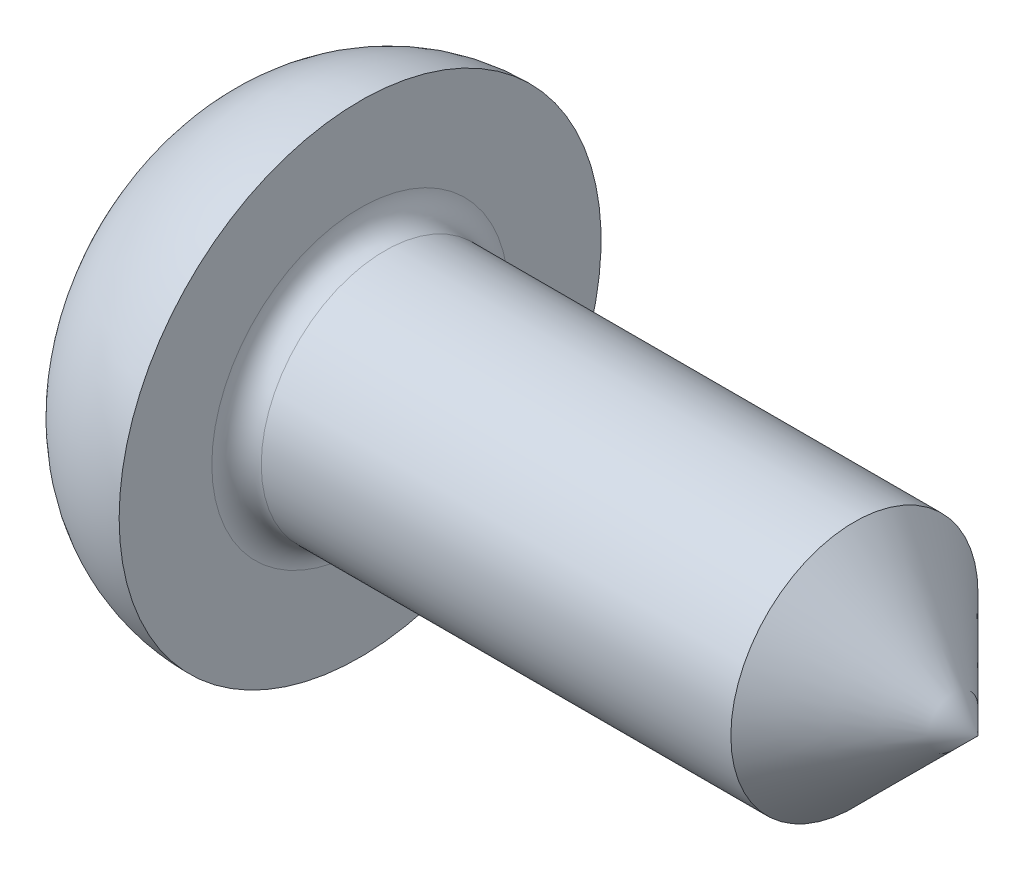
ISO-10303-21;
HEADER;
FILE_DESCRIPTION(('STEP AP214'),'2;1');
FILE_NAME('part.step','',(''),(''),'','','');
FILE_SCHEMA(('AUTOMOTIVE_DESIGN { 1 0 10303 214 1 1 1 1 }'));
ENDSEC;
DATA;
#1=APPLICATION_CONTEXT('core data for automotive mechanical design processes');
#2=APPLICATION_PROTOCOL_DEFINITION('international standard','automotive_design',2000,#1);
#3=PRODUCT_CONTEXT('',#1,'mechanical');
#4=PRODUCT('Part','Part','',(#3));
#5=PRODUCT_RELATED_PRODUCT_CATEGORY('part','',(#4));
#6=PRODUCT_DEFINITION_FORMATION('','',#4);
#7=PRODUCT_DEFINITION_CONTEXT('part definition',#1,'design');
#8=PRODUCT_DEFINITION('design','',#6,#7);
#9=PRODUCT_DEFINITION_SHAPE('','',#8);
#10=(LENGTH_UNIT() NAMED_UNIT(*) SI_UNIT(.MILLI.,.METRE.));
#11=(NAMED_UNIT(*) PLANE_ANGLE_UNIT() SI_UNIT($,.RADIAN.));
#12=(NAMED_UNIT(*) SI_UNIT($,.STERADIAN.) SOLID_ANGLE_UNIT());
#13=UNCERTAINTY_MEASURE_WITH_UNIT(LENGTH_MEASURE(1.E-05),#10,'distance_accuracy_value','');
#14=(GEOMETRIC_REPRESENTATION_CONTEXT(3) GLOBAL_UNCERTAINTY_ASSIGNED_CONTEXT((#13)) GLOBAL_UNIT_ASSIGNED_CONTEXT((#10,
#11,#12)) REPRESENTATION_CONTEXT('',''));
#15=CARTESIAN_POINT('',(0.,0.,0.));
#16=DIRECTION('',(0.,0.,1.));
#17=DIRECTION('',(1.,0.,0.));
#18=AXIS2_PLACEMENT_3D('',#15,#16,#17);
#19=CARTESIAN_POINT('',(-13.6292682926829,0.,0.));
#20=DIRECTION('',(-1.,0.,0.));
#21=DIRECTION('',(0.,0.,1.));
#22=AXIS2_PLACEMENT_3D('',#19,#20,#21);
#23=CYLINDRICAL_SURFACE('',#22,1.);
#24=CARTESIAN_POINT('',(1.8,0.,0.));
#25=DIRECTION('',(-1.,0.,0.));
#26=DIRECTION('',(0.,0.,1.));
#27=AXIS2_PLACEMENT_3D('',#24,#25,#26);
#28=CIRCLE('',#27,1.);
#29=CARTESIAN_POINT('',(1.8,0.,1.));
#30=VERTEX_POINT('',#29);
#31=EDGE_CURVE('E219',#30,#30,#28,.F.);
#32=ORIENTED_EDGE('',*,*,#31,.T.);
#33=EDGE_LOOP('',(#32));
#34=FACE_BOUND('',#33,.T.);
#35=CARTESIAN_POINT('',(5.6,0.,0.));
#36=DIRECTION('',(-1.,0.,0.));
#37=DIRECTION('',(0.,0.,1.));
#38=AXIS2_PLACEMENT_3D('',#35,#36,#37);
#39=CIRCLE('',#38,1.);
#40=CARTESIAN_POINT('',(5.6,0.,1.));
#41=VERTEX_POINT('',#40);
#42=EDGE_CURVE('E185',#41,#41,#39,.F.);
#43=ORIENTED_EDGE('',*,*,#42,.F.);
#44=EDGE_LOOP('',(#43));
#45=FACE_BOUND('',#44,.T.);
#46=ADVANCED_FACE('F48',(#34,#45),#23,.T.);
#47=CARTESIAN_POINT('',(2.3,0.,0.));
#48=DIRECTION('',(-1.,0.,0.));
#49=DIRECTION('',(0.,0.,-1.));
#50=AXIS2_PLACEMENT_3D('',#47,#48,#49);
#51=SPHERICAL_SURFACE('',#50,2.3);
#52=CARTESIAN_POINT('',(2.1589518555667,-0.208751253761284,0.));
#53=DIRECTION('',(0.559857411277987,0.82858896869142,0.));
#54=DIRECTION('',(-0.82858896869142,0.559857411277987,0.));
#55=AXIS2_PLACEMENT_3D('',#52,#53,#54);
#56=CIRCLE('',#55,2.28616017264867);
#57=CARTESIAN_POINT('',(0.27749446027142,1.06250374305985,-0.265625935764963));
#58=VERTEX_POINT('',#57);
#59=CARTESIAN_POINT('',(0.27749446027142,1.06250374305985,0.265625935764963));
#60=VERTEX_POINT('',#59);
#61=EDGE_CURVE('E173',#58,#60,#56,.T.);
#62=ORIENTED_EDGE('',*,*,#61,.T.);
#63=CARTESIAN_POINT('',(2.28751609037241,0.,-0.0739047449953394));
#64=DIRECTION('',(0.166559362975027,0.,0.986031428812162));
#65=DIRECTION('',(0.986031428812162,0.,-0.166559362975027));
#66=AXIS2_PLACEMENT_3D('',#63,#64,#65);
#67=CIRCLE('',#66,2.29877842356926);
#68=CARTESIAN_POINT('',(0.0409645117173431,0.305580318966665,0.305580318966665));
#69=VERTEX_POINT('',#68);
#70=EDGE_CURVE('E12',#60,#69,#67,.T.);
#71=ORIENTED_EDGE('',*,*,#70,.T.);
#72=CARTESIAN_POINT('',(2.28751609037241,-0.0739047449953392,0.));
#73=DIRECTION('',(0.166559362975027,0.986031428812162,0.));
#74=DIRECTION('',(-0.986031428812162,0.166559362975027,0.));
#75=AXIS2_PLACEMENT_3D('',#72,#73,#74);
#76=CIRCLE('',#75,2.29877842356926);
#77=CARTESIAN_POINT('',(0.27749446027142,0.265625935764963,1.06250374305985));
#78=VERTEX_POINT('',#77);
#79=EDGE_CURVE('E56',#69,#78,#76,.T.);
#80=ORIENTED_EDGE('',*,*,#79,.T.);
#81=CARTESIAN_POINT('',(2.1589518555667,0.,-0.208751253761284));
#82=DIRECTION('',(0.559857411277987,0.,0.82858896869142));
#83=DIRECTION('',(0.82858896869142,0.,-0.559857411277987));
#84=AXIS2_PLACEMENT_3D('',#81,#82,#83);
#85=CIRCLE('',#84,2.28616017264867);
#86=CARTESIAN_POINT('',(0.27749446027142,-0.265625935764963,1.06250374305985));
#87=VERTEX_POINT('',#86);
#88=EDGE_CURVE('E188',#78,#87,#85,.T.);
#89=ORIENTED_EDGE('',*,*,#88,.T.);
#90=CARTESIAN_POINT('',(2.28751609037241,0.0739047449953392,0.));
#91=DIRECTION('',(0.166559362975027,-0.986031428812162,0.));
#92=DIRECTION('',(0.986031428812162,0.166559362975027,0.));
#93=AXIS2_PLACEMENT_3D('',#90,#91,#92);
#94=CIRCLE('',#93,2.29877842356926);
#95=CARTESIAN_POINT('',(0.0409645117173431,-0.305580318966665,0.305580318966665));
#96=VERTEX_POINT('',#95);
#97=EDGE_CURVE('E107',#87,#96,#94,.T.);
#98=ORIENTED_EDGE('',*,*,#97,.T.);
#99=CARTESIAN_POINT('',(2.28751609037241,0.,-0.0739047449953392));
#100=DIRECTION('',(0.166559362975027,0.,0.986031428812162));
#101=DIRECTION('',(0.986031428812162,0.,-0.166559362975027));
#102=AXIS2_PLACEMENT_3D('',#99,#100,#101);
#103=CIRCLE('',#102,2.29877842356926);
#104=CARTESIAN_POINT('',(0.27749446027142,-1.06250374305985,0.265625935764963));
#105=VERTEX_POINT('',#104);
#106=EDGE_CURVE('E117',#96,#105,#103,.T.);
#107=ORIENTED_EDGE('',*,*,#106,.T.);
#108=CARTESIAN_POINT('',(2.1589518555667,0.208751253761284,0.));
#109=DIRECTION('',(0.559857411277987,-0.82858896869142,0.));
#110=DIRECTION('',(0.82858896869142,0.559857411277987,0.));
#111=AXIS2_PLACEMENT_3D('',#108,#109,#110);
#112=CIRCLE('',#111,2.28616017264867);
#113=CARTESIAN_POINT('',(0.27749446027142,-1.06250374305985,-0.265625935764963));
#114=VERTEX_POINT('',#113);
#115=EDGE_CURVE('E125',#105,#114,#112,.T.);
#116=ORIENTED_EDGE('',*,*,#115,.T.);
#117=CARTESIAN_POINT('',(2.28751609037241,0.,0.0739047449953394));
#118=DIRECTION('',(0.166559362975027,0.,-0.986031428812162));
#119=DIRECTION('',(-0.986031428812162,0.,-0.166559362975027));
#120=AXIS2_PLACEMENT_3D('',#117,#118,#119);
#121=CIRCLE('',#120,2.29877842356926);
#122=CARTESIAN_POINT('',(0.0409645117173431,-0.305580318966665,-0.305580318966665));
#123=VERTEX_POINT('',#122);
#124=EDGE_CURVE('E133',#114,#123,#121,.T.);
#125=ORIENTED_EDGE('',*,*,#124,.T.);
#126=CARTESIAN_POINT('',(2.28751609037241,0.0739047449953392,0.));
#127=DIRECTION('',(0.166559362975027,-0.986031428812162,0.));
#128=DIRECTION('',(0.986031428812162,0.166559362975027,0.));
#129=AXIS2_PLACEMENT_3D('',#126,#127,#128);
#130=CIRCLE('',#129,2.29877842356926);
#131=CARTESIAN_POINT('',(0.27749446027142,-0.265625935764963,-1.06250374305985));
#132=VERTEX_POINT('',#131);
#133=EDGE_CURVE('E141',#123,#132,#130,.T.);
#134=ORIENTED_EDGE('',*,*,#133,.T.);
#135=CARTESIAN_POINT('',(2.1589518555667,0.,0.208751253761284));
#136=DIRECTION('',(0.559857411277987,0.,-0.82858896869142));
#137=DIRECTION('',(-0.82858896869142,0.,-0.559857411277987));
#138=AXIS2_PLACEMENT_3D('',#135,#136,#137);
#139=CIRCLE('',#138,2.28616017264867);
#140=CARTESIAN_POINT('',(0.27749446027142,0.265625935764963,-1.06250374305985));
#141=VERTEX_POINT('',#140);
#142=EDGE_CURVE('E149',#132,#141,#139,.T.);
#143=ORIENTED_EDGE('',*,*,#142,.T.);
#144=CARTESIAN_POINT('',(2.28751609037241,-0.0739047449953392,0.));
#145=DIRECTION('',(0.166559362975027,0.986031428812162,0.));
#146=DIRECTION('',(-0.986031428812162,0.166559362975027,0.));
#147=AXIS2_PLACEMENT_3D('',#144,#145,#146);
#148=CIRCLE('',#147,2.29877842356926);
#149=CARTESIAN_POINT('',(0.0409645117173431,0.305580318966665,-0.305580318966665));
#150=VERTEX_POINT('',#149);
#151=EDGE_CURVE('E157',#141,#150,#148,.T.);
#152=ORIENTED_EDGE('',*,*,#151,.T.);
#153=CARTESIAN_POINT('',(2.28751609037241,0.,0.0739047449953392));
#154=DIRECTION('',(0.166559362975027,0.,-0.986031428812162));
#155=DIRECTION('',(-0.986031428812162,0.,-0.166559362975027));
#156=AXIS2_PLACEMENT_3D('',#153,#154,#155);
#157=CIRCLE('',#156,2.29877842356926);
#158=EDGE_CURVE('E165',#150,#58,#157,.T.);
#159=ORIENTED_EDGE('',*,*,#158,.T.);
#160=EDGE_LOOP('',(#62,#71,#80,#89,#98,#107,#116,#125,#134,#143,#152,#159));
#161=FACE_BOUND('',#160,.T.);
#162=CARTESIAN_POINT('',(0.479554358167092,0.,0.));
#163=DIRECTION('',(-1.,0.,0.));
#164=DIRECTION('',(0.,0.,1.));
#165=AXIS2_PLACEMENT_3D('',#162,#163,#164);
#166=CIRCLE('',#165,1.4056947268634);
#167=CARTESIAN_POINT('',(0.479554358167092,0.,1.4056947268634));
#168=VERTEX_POINT('',#167);
#169=EDGE_CURVE('E213',#168,#168,#166,.T.);
#170=ORIENTED_EDGE('',*,*,#169,.T.);
#171=EDGE_LOOP('',(#170));
#172=FACE_BOUND('',#171,.T.);
#173=ADVANCED_FACE('F234',(#161,#172),#51,.T.);
#174=CARTESIAN_POINT('',(1.58765170536973,0.,0.));
#175=DIRECTION('',(-1.,0.,0.));
#176=DIRECTION('',(0.,0.,1.));
#177=AXIS2_PLACEMENT_3D('',#174,#175,#176);
#178=DEGENERATE_TOROIDAL_SURFACE('',#177,0.550054458337852,1.4,.T.);
#179=ORIENTED_EDGE('',*,*,#169,.F.);
#180=EDGE_LOOP('',(#179));
#181=FACE_BOUND('',#180,.T.);
#182=CARTESIAN_POINT('',(1.6,0.,0.));
#183=DIRECTION('',(-1.,0.,0.));
#184=DIRECTION('',(0.,0.,1.));
#185=AXIS2_PLACEMENT_3D('',#182,#183,#184);
#186=CIRCLE('',#185,1.95);
#187=CARTESIAN_POINT('',(1.6,0.,1.95));
#188=VERTEX_POINT('',#187);
#189=EDGE_CURVE('E209',#188,#188,#186,.T.);
#190=ORIENTED_EDGE('',*,*,#189,.T.);
#191=EDGE_LOOP('',(#190));
#192=FACE_BOUND('',#191,.T.);
#193=ADVANCED_FACE('F237',(#181,#192),#178,.T.);
#194=CARTESIAN_POINT('',(1.6,0.,-1.));
#195=DIRECTION('',(-1.,0.,0.));
#196=DIRECTION('',(0.,0.,1.));
#197=AXIS2_PLACEMENT_3D('',#194,#195,#196);
#198=PLANE('',#197);
#199=CARTESIAN_POINT('',(1.6,0.,0.));
#200=DIRECTION('',(-1.,0.,0.));
#201=DIRECTION('',(0.,0.,1.));
#202=AXIS2_PLACEMENT_3D('',#199,#200,#201);
#203=CIRCLE('',#202,1.2);
#204=CARTESIAN_POINT('',(1.6,0.,1.2));
#205=VERTEX_POINT('',#204);
#206=EDGE_CURVE('E216',#205,#205,#203,.T.);
#207=ORIENTED_EDGE('',*,*,#206,.T.);
#208=EDGE_LOOP('',(#207));
#209=FACE_BOUND('',#208,.T.);
#210=ORIENTED_EDGE('',*,*,#189,.F.);
#211=EDGE_LOOP('',(#210));
#212=FACE_BOUND('',#211,.T.);
#213=ADVANCED_FACE('F242',(#209,#212),#198,.F.);
#214=CARTESIAN_POINT('',(1.8,0.,0.));
#215=DIRECTION('',(-1.,0.,0.));
#216=DIRECTION('',(0.,0.,1.));
#217=AXIS2_PLACEMENT_3D('',#214,#215,#216);
#218=TOROIDAL_SURFACE('',#217,1.2,0.2);
#219=ORIENTED_EDGE('',*,*,#31,.F.);
#220=EDGE_LOOP('',(#219));
#221=FACE_BOUND('',#220,.T.);
#222=ORIENTED_EDGE('',*,*,#206,.F.);
#223=EDGE_LOOP('',(#222));
#224=FACE_BOUND('',#223,.T.);
#225=ADVANCED_FACE('F50',(#221,#224),#218,.F.);
#226=CARTESIAN_POINT('',(-14.3999999999999,0.,0.));
#227=DIRECTION('',(-1.,0.,0.));
#228=DIRECTION('',(0.,0.,1.));
#229=AXIS2_PLACEMENT_3D('',#226,#227,#228);
#230=CONICAL_SURFACE('',#229,21.,0.78539816339745);
#231=CARTESIAN_POINT('',(6.6,0.,0.));
#232=VERTEX_POINT('',#231);
#233=VERTEX_LOOP('',#232);
#234=FACE_BOUND('',#233,.T.);
#235=ORIENTED_EDGE('',*,*,#42,.T.);
#236=EDGE_LOOP('',(#235));
#237=FACE_BOUND('',#236,.T.);
#238=ADVANCED_FACE('F252',(#234,#237),#230,.T.);
#239=CARTESIAN_POINT('',(0.,1.25,0.3125));
#240=DIRECTION('',(0.166559362975027,0.,0.986031428812162));
#241=DIRECTION('',(0.986031428812162,0.,-0.166559362975027));
#242=AXIS2_PLACEMENT_3D('',#239,#240,#241);
#243=PLANE('',#242);
#244=DIRECTION('',(-0.820590262545752,0.554452880098481,0.13861322002462));
#245=VECTOR('',#244,1.);
#246=CARTESIAN_POINT('',(1.85,0.,0.));
#247=LINE('',#246,#245);
#248=CARTESIAN_POINT('',(1.85,0.,0.));
#249=VERTEX_POINT('',#248);
#250=EDGE_CURVE('E171',#249,#60,#247,.T.);
#251=ORIENTED_EDGE('',*,*,#250,.F.);
#252=DIRECTION('',(-0.97263232917164,0.164296001549263,0.164296001549263));
#253=VECTOR('',#252,1.);
#254=CARTESIAN_POINT('',(1.85,0.,0.));
#255=LINE('',#254,#253);
#256=EDGE_CURVE('E179',#249,#69,#255,.T.);
#257=ORIENTED_EDGE('',*,*,#256,.T.);
#258=ORIENTED_EDGE('',*,*,#70,.F.);
#259=EDGE_LOOP('',(#251,#257,#258));
#260=FACE_BOUND('',#259,.T.);
#261=ADVANCED_FACE('F178',(#260),#243,.F.);
#262=CARTESIAN_POINT('',(0.,0.3125,0.3125));
#263=DIRECTION('',(0.166559362975027,0.986031428812162,0.));
#264=DIRECTION('',(-0.986031428812162,0.166559362975027,0.));
#265=AXIS2_PLACEMENT_3D('',#262,#263,#264);
#266=PLANE('',#265);
#267=ORIENTED_EDGE('',*,*,#256,.F.);
#268=DIRECTION('',(-0.820590262545752,0.13861322002462,0.554452880098481));
#269=VECTOR('',#268,1.);
#270=CARTESIAN_POINT('',(1.85,0.,0.));
#271=LINE('',#270,#269);
#272=EDGE_CURVE('E109',#249,#78,#271,.T.);
#273=ORIENTED_EDGE('',*,*,#272,.T.);
#274=ORIENTED_EDGE('',*,*,#79,.F.);
#275=EDGE_LOOP('',(#267,#273,#274));
#276=FACE_BOUND('',#275,.T.);
#277=ADVANCED_FACE('F183',(#276),#266,.F.);
#278=CARTESIAN_POINT('',(0.,1.25,-0.3125));
#279=DIRECTION('',(0.559857411277987,0.82858896869142,0.));
#280=DIRECTION('',(-0.82858896869142,0.559857411277987,0.));
#281=AXIS2_PLACEMENT_3D('',#278,#279,#280);
#282=PLANE('',#281);
#283=DIRECTION('',(-0.820590262545752,0.554452880098481,-0.13861322002462));
#284=VECTOR('',#283,1.);
#285=CARTESIAN_POINT('',(1.85,0.,0.));
#286=LINE('',#285,#284);
#287=EDGE_CURVE('E163',#249,#58,#286,.T.);
#288=ORIENTED_EDGE('',*,*,#287,.F.);
#289=ORIENTED_EDGE('',*,*,#250,.T.);
#290=ORIENTED_EDGE('',*,*,#61,.F.);
#291=EDGE_LOOP('',(#288,#289,#290));
#292=FACE_BOUND('',#291,.T.);
#293=ADVANCED_FACE('F170',(#292),#282,.F.);
#294=CARTESIAN_POINT('',(0.,0.3125,-0.3125));
#295=DIRECTION('',(0.166559362975027,0.,-0.986031428812162));
#296=DIRECTION('',(-0.986031428812162,0.,-0.166559362975027));
#297=AXIS2_PLACEMENT_3D('',#294,#295,#296);
#298=PLANE('',#297);
#299=DIRECTION('',(-0.97263232917164,0.164296001549263,-0.164296001549263));
#300=VECTOR('',#299,1.);
#301=CARTESIAN_POINT('',(1.85,0.,0.));
#302=LINE('',#301,#300);
#303=EDGE_CURVE('E155',#249,#150,#302,.T.);
#304=ORIENTED_EDGE('',*,*,#303,.F.);
#305=ORIENTED_EDGE('',*,*,#287,.T.);
#306=ORIENTED_EDGE('',*,*,#158,.F.);
#307=EDGE_LOOP('',(#304,#305,#306));
#308=FACE_BOUND('',#307,.T.);
#309=ADVANCED_FACE('F162',(#308),#298,.F.);
#310=CARTESIAN_POINT('',(0.,0.3125,-1.25));
#311=DIRECTION('',(0.166559362975027,0.986031428812162,0.));
#312=DIRECTION('',(-0.986031428812162,0.166559362975027,0.));
#313=AXIS2_PLACEMENT_3D('',#310,#311,#312);
#314=PLANE('',#313);
#315=DIRECTION('',(-0.820590262545752,0.13861322002462,-0.554452880098481));
#316=VECTOR('',#315,1.);
#317=CARTESIAN_POINT('',(1.85,0.,0.));
#318=LINE('',#317,#316);
#319=EDGE_CURVE('E147',#249,#141,#318,.T.);
#320=ORIENTED_EDGE('',*,*,#319,.F.);
#321=ORIENTED_EDGE('',*,*,#303,.T.);
#322=ORIENTED_EDGE('',*,*,#151,.F.);
#323=EDGE_LOOP('',(#320,#321,#322));
#324=FACE_BOUND('',#323,.T.);
#325=ADVANCED_FACE('F154',(#324),#314,.F.);
#326=CARTESIAN_POINT('',(0.,-0.312499999999999,-1.25));
#327=DIRECTION('',(0.559857411277987,0.,-0.82858896869142));
#328=DIRECTION('',(-0.82858896869142,0.,-0.559857411277987));
#329=AXIS2_PLACEMENT_3D('',#326,#327,#328);
#330=PLANE('',#329);
#331=DIRECTION('',(-0.820590262545752,-0.13861322002462,-0.554452880098481));
#332=VECTOR('',#331,1.);
#333=CARTESIAN_POINT('',(1.85,0.,0.));
#334=LINE('',#333,#332);
#335=EDGE_CURVE('E139',#249,#132,#334,.T.);
#336=ORIENTED_EDGE('',*,*,#335,.F.);
#337=ORIENTED_EDGE('',*,*,#319,.T.);
#338=ORIENTED_EDGE('',*,*,#142,.F.);
#339=EDGE_LOOP('',(#336,#337,#338));
#340=FACE_BOUND('',#339,.T.);
#341=ADVANCED_FACE('F146',(#340),#330,.F.);
#342=CARTESIAN_POINT('',(0.,-0.3125,-0.3125));
#343=DIRECTION('',(0.166559362975027,-0.986031428812162,0.));
#344=DIRECTION('',(0.986031428812162,0.166559362975027,0.));
#345=AXIS2_PLACEMENT_3D('',#342,#343,#344);
#346=PLANE('',#345);
#347=DIRECTION('',(-0.97263232917164,-0.164296001549263,-0.164296001549263));
#348=VECTOR('',#347,1.);
#349=CARTESIAN_POINT('',(1.85,0.,0.));
#350=LINE('',#349,#348);
#351=EDGE_CURVE('E131',#249,#123,#350,.T.);
#352=ORIENTED_EDGE('',*,*,#351,.F.);
#353=ORIENTED_EDGE('',*,*,#335,.T.);
#354=ORIENTED_EDGE('',*,*,#133,.F.);
#355=EDGE_LOOP('',(#352,#353,#354));
#356=FACE_BOUND('',#355,.T.);
#357=ADVANCED_FACE('F138',(#356),#346,.F.);
#358=CARTESIAN_POINT('',(0.,-1.25,-0.3125));
#359=DIRECTION('',(0.166559362975027,0.,-0.986031428812162));
#360=DIRECTION('',(-0.986031428812162,0.,-0.166559362975027));
#361=AXIS2_PLACEMENT_3D('',#358,#359,#360);
#362=PLANE('',#361);
#363=DIRECTION('',(-0.820590262545752,-0.554452880098481,-0.13861322002462));
#364=VECTOR('',#363,1.);
#365=CARTESIAN_POINT('',(1.85,0.,0.));
#366=LINE('',#365,#364);
#367=EDGE_CURVE('E123',#249,#114,#366,.T.);
#368=ORIENTED_EDGE('',*,*,#367,.F.);
#369=ORIENTED_EDGE('',*,*,#351,.T.);
#370=ORIENTED_EDGE('',*,*,#124,.F.);
#371=EDGE_LOOP('',(#368,#369,#370));
#372=FACE_BOUND('',#371,.T.);
#373=ADVANCED_FACE('F130',(#372),#362,.F.);
#374=CARTESIAN_POINT('',(0.,-1.25,0.3125));
#375=DIRECTION('',(0.559857411277987,-0.82858896869142,0.));
#376=DIRECTION('',(0.82858896869142,0.559857411277987,0.));
#377=AXIS2_PLACEMENT_3D('',#374,#375,#376);
#378=PLANE('',#377);
#379=DIRECTION('',(-0.820590262545752,-0.554452880098481,0.13861322002462));
#380=VECTOR('',#379,1.);
#381=CARTESIAN_POINT('',(1.85,0.,0.));
#382=LINE('',#381,#380);
#383=EDGE_CURVE('E115',#249,#105,#382,.T.);
#384=ORIENTED_EDGE('',*,*,#383,.F.);
#385=ORIENTED_EDGE('',*,*,#367,.T.);
#386=ORIENTED_EDGE('',*,*,#115,.F.);
#387=EDGE_LOOP('',(#384,#385,#386));
#388=FACE_BOUND('',#387,.T.);
#389=ADVANCED_FACE('F122',(#388),#378,.F.);
#390=CARTESIAN_POINT('',(0.,-0.3125,0.3125));
#391=DIRECTION('',(0.166559362975027,0.,0.986031428812162));
#392=DIRECTION('',(0.986031428812162,0.,-0.166559362975027));
#393=AXIS2_PLACEMENT_3D('',#390,#391,#392);
#394=PLANE('',#393);
#395=DIRECTION('',(-0.97263232917164,-0.164296001549263,0.164296001549263));
#396=VECTOR('',#395,1.);
#397=CARTESIAN_POINT('',(1.85,0.,0.));
#398=LINE('',#397,#396);
#399=EDGE_CURVE('E105',#249,#96,#398,.T.);
#400=ORIENTED_EDGE('',*,*,#399,.F.);
#401=ORIENTED_EDGE('',*,*,#383,.T.);
#402=ORIENTED_EDGE('',*,*,#106,.F.);
#403=EDGE_LOOP('',(#400,#401,#402));
#404=FACE_BOUND('',#403,.T.);
#405=ADVANCED_FACE('F114',(#404),#394,.F.);
#406=CARTESIAN_POINT('',(0.,-0.3125,1.25));
#407=DIRECTION('',(0.166559362975027,-0.986031428812162,0.));
#408=DIRECTION('',(0.986031428812162,0.166559362975027,0.));
#409=AXIS2_PLACEMENT_3D('',#406,#407,#408);
#410=PLANE('',#409);
#411=DIRECTION('',(-0.820590262545752,-0.13861322002462,0.554452880098481));
#412=VECTOR('',#411,1.);
#413=CARTESIAN_POINT('',(1.85,0.,0.));
#414=LINE('',#413,#412);
#415=EDGE_CURVE('E63',#249,#87,#414,.T.);
#416=ORIENTED_EDGE('',*,*,#415,.F.);
#417=ORIENTED_EDGE('',*,*,#399,.T.);
#418=ORIENTED_EDGE('',*,*,#97,.F.);
#419=EDGE_LOOP('',(#416,#417,#418));
#420=FACE_BOUND('',#419,.T.);
#421=ADVANCED_FACE('F104',(#420),#410,.F.);
#422=CARTESIAN_POINT('',(0.,0.3125,1.25));
#423=DIRECTION('',(0.559857411277987,0.,0.82858896869142));
#424=DIRECTION('',(0.82858896869142,0.,-0.559857411277987));
#425=AXIS2_PLACEMENT_3D('',#422,#423,#424);
#426=PLANE('',#425);
#427=ORIENTED_EDGE('',*,*,#272,.F.);
#428=ORIENTED_EDGE('',*,*,#415,.T.);
#429=ORIENTED_EDGE('',*,*,#88,.F.);
#430=EDGE_LOOP('',(#427,#428,#429));
#431=FACE_BOUND('',#430,.T.);
#432=ADVANCED_FACE('F187',(#431),#426,.F.);
#433=CLOSED_SHELL('',(#46,#173,#193,#213,#225,#238,#261,#277,#293,#309,#325,#341,#357,#373,#389,
#405,#421,#432));
#434=MANIFOLD_SOLID_BREP('B2',#433);
#435=ADVANCED_BREP_SHAPE_REPRESENTATION('',(#18,#434),#14);
#436=SHAPE_DEFINITION_REPRESENTATION(#9,#435);
ENDSEC;
END-ISO-10303-21;
